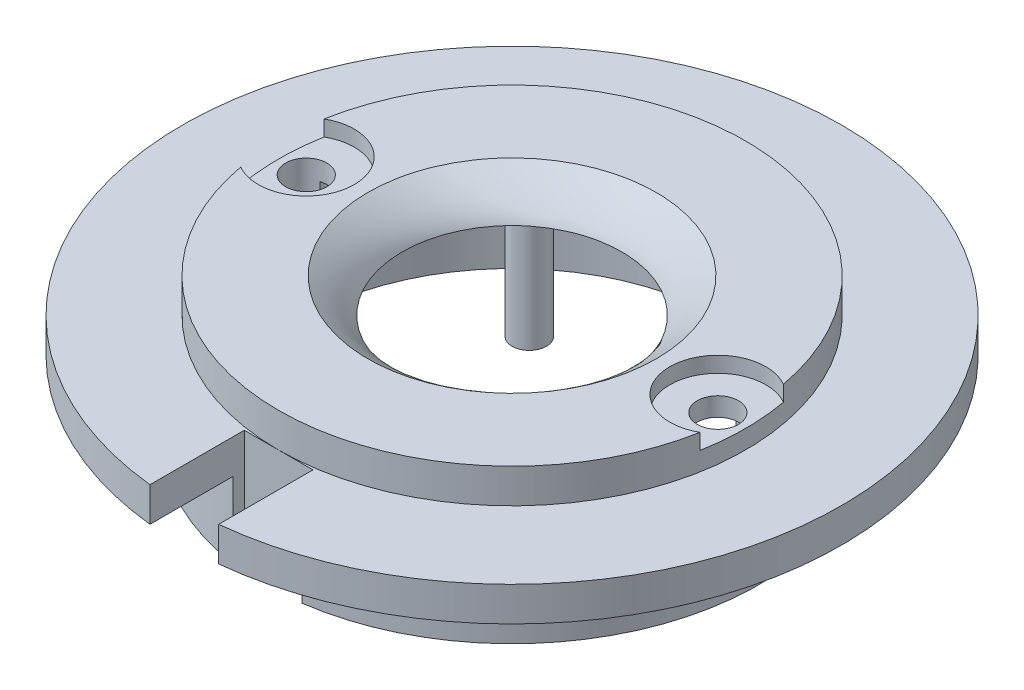
ISO-10303-21;
HEADER;
FILE_DESCRIPTION(('STEP AP214'),'2;1');
FILE_NAME('part.step','',(''),(''),'','','');
FILE_SCHEMA(('AUTOMOTIVE_DESIGN { 1 0 10303 214 1 1 1 1 }'));
ENDSEC;
DATA;
#1=APPLICATION_CONTEXT('core data for automotive mechanical design processes');
#2=APPLICATION_PROTOCOL_DEFINITION('international standard','automotive_design',2000,#1);
#3=PRODUCT_CONTEXT('',#1,'mechanical');
#4=PRODUCT('Part','Part','',(#3));
#5=PRODUCT_RELATED_PRODUCT_CATEGORY('part','',(#4));
#6=PRODUCT_DEFINITION_FORMATION('','',#4);
#7=PRODUCT_DEFINITION_CONTEXT('part definition',#1,'design');
#8=PRODUCT_DEFINITION('design','',#6,#7);
#9=PRODUCT_DEFINITION_SHAPE('','',#8);
#10=(LENGTH_UNIT() NAMED_UNIT(*) SI_UNIT(.MILLI.,.METRE.));
#11=(NAMED_UNIT(*) PLANE_ANGLE_UNIT() SI_UNIT($,.RADIAN.));
#12=(NAMED_UNIT(*) SI_UNIT($,.STERADIAN.) SOLID_ANGLE_UNIT());
#13=UNCERTAINTY_MEASURE_WITH_UNIT(LENGTH_MEASURE(1.E-05),#10,'distance_accuracy_value','');
#14=(GEOMETRIC_REPRESENTATION_CONTEXT(3) GLOBAL_UNCERTAINTY_ASSIGNED_CONTEXT((#13)) GLOBAL_UNIT_ASSIGNED_CONTEXT((#10,
#11,#12)) REPRESENTATION_CONTEXT('',''));
#15=CARTESIAN_POINT('',(0.,0.,0.));
#16=DIRECTION('',(0.,0.,1.));
#17=DIRECTION('',(1.,0.,0.));
#18=AXIS2_PLACEMENT_3D('',#15,#16,#17);
#19=CARTESIAN_POINT('',(19.0334033867562,-10.16,0.));
#20=DIRECTION('',(0.,1.,0.));
#21=DIRECTION('',(0.,0.,1.));
#22=AXIS2_PLACEMENT_3D('',#19,#20,#21);
#23=CYLINDRICAL_SURFACE('',#22,1.905);
#24=DIRECTION('',(0.,1.,0.));
#25=VECTOR('',#24,1.);
#26=CARTESIAN_POINT('',(19.5836628930449,-3.49245,-1.82379809072685));
#27=LINE('',#26,#25);
#28=CARTESIAN_POINT('',(19.5836628930449,0.,-1.82379809072684));
#29=VERTEX_POINT('',#28);
#30=CARTESIAN_POINT('',(19.5836628930449,-10.16,-1.82379809072685));
#31=VERTEX_POINT('',#30);
#32=EDGE_CURVE('E277',#29,#31,#27,.F.);
#33=ORIENTED_EDGE('',*,*,#32,.T.);
#34=CARTESIAN_POINT('',(19.0334033867562,-10.16,0.));
#35=DIRECTION('',(0.,1.,0.));
#36=DIRECTION('',(0.,0.,1.));
#37=AXIS2_PLACEMENT_3D('',#34,#35,#36);
#38=CIRCLE('',#37,1.905);
#39=CARTESIAN_POINT('',(19.5836628930449,-10.16,1.82379809072685));
#40=VERTEX_POINT('',#39);
#41=EDGE_CURVE('E190',#40,#31,#38,.T.);
#42=ORIENTED_EDGE('',*,*,#41,.F.);
#43=DIRECTION('',(0.,1.,0.));
#44=VECTOR('',#43,1.);
#45=CARTESIAN_POINT('',(19.5836628930449,-3.49245,1.82379809072685));
#46=LINE('',#45,#44);
#47=CARTESIAN_POINT('',(19.5836628930449,0.,1.82379809072685));
#48=VERTEX_POINT('',#47);
#49=EDGE_CURVE('E253',#40,#48,#46,.T.);
#50=ORIENTED_EDGE('',*,*,#49,.T.);
#51=CARTESIAN_POINT('',(19.0334033867562,0.,0.));
#52=DIRECTION('',(0.,1.,0.));
#53=DIRECTION('',(0.,0.,1.));
#54=AXIS2_PLACEMENT_3D('',#51,#52,#53);
#55=CIRCLE('',#54,1.905);
#56=EDGE_CURVE('E193',#29,#48,#55,.T.);
#57=ORIENTED_EDGE('',*,*,#56,.F.);
#58=EDGE_LOOP('',(#33,#42,#50,#57));
#59=FACE_BOUND('',#58,.T.);
#60=CARTESIAN_POINT('',(19.0334033867562,1.7272,0.));
#61=DIRECTION('',(0.,1.,0.));
#62=DIRECTION('',(0.,0.,1.));
#63=AXIS2_PLACEMENT_3D('',#60,#61,#62);
#64=CIRCLE('',#63,1.905);
#65=CARTESIAN_POINT('',(19.0334033867562,1.7272,1.905));
#66=VERTEX_POINT('',#65);
#67=EDGE_CURVE('E332',#66,#66,#64,.F.);
#68=ORIENTED_EDGE('',*,*,#67,.F.);
#69=EDGE_LOOP('',(#68));
#70=FACE_BOUND('',#69,.T.);
#71=ADVANCED_FACE('F48',(#59,#70),#23,.F.);
#72=CARTESIAN_POINT('',(-19.0334033867562,-10.16,0.));
#73=DIRECTION('',(0.,1.,0.));
#74=DIRECTION('',(0.,0.,1.));
#75=AXIS2_PLACEMENT_3D('',#72,#73,#74);
#76=CYLINDRICAL_SURFACE('',#75,1.905);
#77=DIRECTION('',(0.,1.,0.));
#78=VECTOR('',#77,1.);
#79=CARTESIAN_POINT('',(-19.5836628930449,-3.49245,1.82379809072685));
#80=LINE('',#79,#78);
#81=CARTESIAN_POINT('',(-19.5836628930449,0.,1.82379809072684));
#82=VERTEX_POINT('',#81);
#83=CARTESIAN_POINT('',(-19.5836628930449,-10.16,1.82379809072685));
#84=VERTEX_POINT('',#83);
#85=EDGE_CURVE('E282',#82,#84,#80,.F.);
#86=ORIENTED_EDGE('',*,*,#85,.T.);
#87=CARTESIAN_POINT('',(-19.0334033867562,-10.16,0.));
#88=DIRECTION('',(0.,1.,0.));
#89=DIRECTION('',(0.,0.,1.));
#90=AXIS2_PLACEMENT_3D('',#87,#88,#89);
#91=CIRCLE('',#90,1.905);
#92=CARTESIAN_POINT('',(-19.5836628930449,-10.16,-1.82379809072685));
#93=VERTEX_POINT('',#92);
#94=EDGE_CURVE('E180',#93,#84,#91,.T.);
#95=ORIENTED_EDGE('',*,*,#94,.F.);
#96=DIRECTION('',(0.,1.,0.));
#97=VECTOR('',#96,1.);
#98=CARTESIAN_POINT('',(-19.5836628930449,-3.49245,-1.82379809072685));
#99=LINE('',#98,#97);
#100=CARTESIAN_POINT('',(-19.5836628930449,0.,-1.82379809072686));
#101=VERTEX_POINT('',#100);
#102=EDGE_CURVE('E280',#93,#101,#99,.T.);
#103=ORIENTED_EDGE('',*,*,#102,.T.);
#104=CARTESIAN_POINT('',(-19.0334033867562,0.,0.));
#105=DIRECTION('',(0.,1.,0.));
#106=DIRECTION('',(0.,0.,1.));
#107=AXIS2_PLACEMENT_3D('',#104,#105,#106);
#108=CIRCLE('',#107,1.905);
#109=EDGE_CURVE('E187',#82,#101,#108,.T.);
#110=ORIENTED_EDGE('',*,*,#109,.F.);
#111=EDGE_LOOP('',(#86,#95,#103,#110));
#112=FACE_BOUND('',#111,.T.);
#113=CARTESIAN_POINT('',(-19.0334033867562,1.7272,0.));
#114=DIRECTION('',(0.,1.,0.));
#115=DIRECTION('',(0.,0.,1.));
#116=AXIS2_PLACEMENT_3D('',#113,#114,#115);
#117=CIRCLE('',#116,1.905);
#118=CARTESIAN_POINT('',(-19.0334033867562,1.7272,1.905));
#119=VERTEX_POINT('',#118);
#120=EDGE_CURVE('E338',#119,#119,#117,.F.);
#121=ORIENTED_EDGE('',*,*,#120,.F.);
#122=EDGE_LOOP('',(#121));
#123=FACE_BOUND('',#122,.T.);
#124=ADVANCED_FACE('F318',(#112,#123),#76,.F.);
#125=CARTESIAN_POINT('',(0.,-3.175,0.));
#126=DIRECTION('',(0.,1.,0.));
#127=DIRECTION('',(0.,0.,1.));
#128=AXIS2_PLACEMENT_3D('',#125,#126,#127);
#129=CYLINDRICAL_SURFACE('',#128,30.48);
#130=DIRECTION('',(0.,1.,0.));
#131=VECTOR('',#130,1.);
#132=CARTESIAN_POINT('',(3.175,-3.175,30.3141843861912));
#133=LINE('',#132,#131);
#134=CARTESIAN_POINT('',(3.175,-3.175,30.3141843861912));
#135=VERTEX_POINT('',#134);
#136=CARTESIAN_POINT('',(3.175,0.,30.3141843861912));
#137=VERTEX_POINT('',#136);
#138=EDGE_CURVE('E363',#135,#137,#133,.T.);
#139=ORIENTED_EDGE('',*,*,#138,.F.);
#140=CARTESIAN_POINT('',(0.,-3.175,0.));
#141=DIRECTION('',(0.,1.,0.));
#142=DIRECTION('',(0.,0.,1.));
#143=AXIS2_PLACEMENT_3D('',#140,#141,#142);
#144=CIRCLE('',#143,30.48);
#145=CARTESIAN_POINT('',(-3.175,-3.175,30.3141843861912));
#146=VERTEX_POINT('',#145);
#147=EDGE_CURVE('E287',#135,#146,#144,.T.);
#148=ORIENTED_EDGE('',*,*,#147,.T.);
#149=DIRECTION('',(0.,1.,0.));
#150=VECTOR('',#149,1.);
#151=CARTESIAN_POINT('',(-3.175,-3.175,30.3141843861912));
#152=LINE('',#151,#150);
#153=CARTESIAN_POINT('',(-3.175,0.,30.3141843861912));
#154=VERTEX_POINT('',#153);
#155=EDGE_CURVE('E355',#154,#146,#152,.F.);
#156=ORIENTED_EDGE('',*,*,#155,.F.);
#157=CARTESIAN_POINT('',(0.,0.,0.));
#158=DIRECTION('',(0.,1.,0.));
#159=DIRECTION('',(0.,0.,1.));
#160=AXIS2_PLACEMENT_3D('',#157,#158,#159);
#161=CIRCLE('',#160,30.48);
#162=EDGE_CURVE('E373',#137,#154,#161,.T.);
#163=ORIENTED_EDGE('',*,*,#162,.F.);
#164=EDGE_LOOP('',(#139,#148,#156,#163));
#165=FACE_BOUND('',#164,.T.);
#166=ADVANCED_FACE('F398',(#165),#129,.T.);
#167=CARTESIAN_POINT('',(0.,0.,0.));
#168=DIRECTION('',(0.,1.,0.));
#169=DIRECTION('',(0.,0.,1.));
#170=AXIS2_PLACEMENT_3D('',#167,#168,#169);
#171=CYLINDRICAL_SURFACE('',#170,22.8434033867562);
#172=DIRECTION('',(0.,1.,0.));
#173=VECTOR('',#172,1.);
#174=CARTESIAN_POINT('',(3.175,0.,22.6216810447425));
#175=LINE('',#174,#173);
#176=CARTESIAN_POINT('',(3.175,-10.16,22.6216810447425));
#177=VERTEX_POINT('',#176);
#178=CARTESIAN_POINT('',(3.175,-3.175,22.6216810447425));
#179=VERTEX_POINT('',#178);
#180=EDGE_CURVE('E367',#177,#179,#175,.T.);
#181=ORIENTED_EDGE('',*,*,#180,.F.);
#182=CARTESIAN_POINT('',(0.,-10.16,0.));
#183=DIRECTION('',(0.,-1.,0.));
#184=DIRECTION('',(0.,0.,-1.));
#185=AXIS2_PLACEMENT_3D('',#182,#183,#184);
#186=CIRCLE('',#185,22.8434033867562);
#187=CARTESIAN_POINT('',(-3.175,-10.16,22.6216810447425));
#188=VERTEX_POINT('',#187);
#189=EDGE_CURVE('E200',#188,#177,#186,.T.);
#190=ORIENTED_EDGE('',*,*,#189,.F.);
#191=DIRECTION('',(0.,1.,0.));
#192=VECTOR('',#191,1.);
#193=CARTESIAN_POINT('',(-3.175,0.,22.6216810447425));
#194=LINE('',#193,#192);
#195=CARTESIAN_POINT('',(-3.175,-3.175,22.6216810447425));
#196=VERTEX_POINT('',#195);
#197=EDGE_CURVE('E361',#196,#188,#194,.F.);
#198=ORIENTED_EDGE('',*,*,#197,.F.);
#199=CARTESIAN_POINT('',(0.,-3.175,0.));
#200=DIRECTION('',(0.,1.,0.));
#201=DIRECTION('',(0.,0.,1.));
#202=AXIS2_PLACEMENT_3D('',#199,#200,#201);
#203=CIRCLE('',#202,22.8434033867562);
#204=EDGE_CURVE('E182',#196,#179,#203,.F.);
#205=ORIENTED_EDGE('',*,*,#204,.T.);
#206=EDGE_LOOP('',(#181,#190,#198,#205));
#207=FACE_BOUND('',#206,.T.);
#208=ADVANCED_FACE('F231',(#207),#171,.T.);
#209=CARTESIAN_POINT('',(0.,3.175,0.));
#210=DIRECTION('',(0.,1.,0.));
#211=DIRECTION('',(0.,0.,1.));
#212=AXIS2_PLACEMENT_3D('',#209,#210,#211);
#213=PLANE('',#212);
#214=CARTESIAN_POINT('',(19.0334033867562,3.175,0.));
#215=DIRECTION('',(0.,1.,0.));
#216=DIRECTION('',(0.,0.,1.));
#217=AXIS2_PLACEMENT_3D('',#214,#215,#216);
#218=CIRCLE('',#217,4.445);
#219=CARTESIAN_POINT('',(21.2426675106789,3.175,-3.85709437669705));
#220=VERTEX_POINT('',#219);
#221=CARTESIAN_POINT('',(21.2426675106789,3.175,3.85709437669705));
#222=VERTEX_POINT('',#221);
#223=EDGE_CURVE('E152',#220,#222,#218,.T.);
#224=ORIENTED_EDGE('',*,*,#223,.F.);
#225=CARTESIAN_POINT('',(0.,3.175,0.));
#226=DIRECTION('',(0.,1.,0.));
#227=DIRECTION('',(0.,0.,1.));
#228=AXIS2_PLACEMENT_3D('',#225,#226,#227);
#229=CIRCLE('',#228,21.59);
#230=CARTESIAN_POINT('',(-21.2426675106789,3.175,-3.85709437669705));
#231=VERTEX_POINT('',#230);
#232=EDGE_CURVE('E177',#220,#231,#229,.T.);
#233=ORIENTED_EDGE('',*,*,#232,.T.);
#234=CARTESIAN_POINT('',(-19.0334033867562,3.175,0.));
#235=DIRECTION('',(0.,1.,0.));
#236=DIRECTION('',(0.,0.,1.));
#237=AXIS2_PLACEMENT_3D('',#234,#235,#236);
#238=CIRCLE('',#237,4.445);
#239=CARTESIAN_POINT('',(-21.2426675106789,3.175,3.85709437669705));
#240=VERTEX_POINT('',#239);
#241=EDGE_CURVE('E175',#240,#231,#238,.T.);
#242=ORIENTED_EDGE('',*,*,#241,.F.);
#243=EDGE_CURVE('E169',#240,#222,#229,.T.);
#244=ORIENTED_EDGE('',*,*,#243,.T.);
#245=EDGE_LOOP('',(#224,#233,#242,#244));
#246=FACE_BOUND('',#245,.T.);
#247=CARTESIAN_POINT('',(0.,3.175,0.));
#248=DIRECTION('',(0.,1.,0.));
#249=DIRECTION('',(0.,0.,1.));
#250=AXIS2_PLACEMENT_3D('',#247,#248,#249);
#251=CIRCLE('',#250,13.335);
#252=CARTESIAN_POINT('',(11.7176932951428,3.175,6.36536635559691));
#253=VERTEX_POINT('',#252);
#254=EDGE_CURVE('E207',#253,#253,#251,.T.);
#255=ORIENTED_EDGE('',*,*,#254,.F.);
#256=EDGE_LOOP('',(#255));
#257=FACE_BOUND('',#256,.T.);
#258=ADVANCED_FACE('F50',(#246,#257),#213,.T.);
#259=CARTESIAN_POINT('',(0.,-10.16,0.));
#260=DIRECTION('',(0.,1.,0.));
#261=DIRECTION('',(0.,0.,1.));
#262=AXIS2_PLACEMENT_3D('',#259,#260,#261);
#263=CYLINDRICAL_SURFACE('',#262,19.6684033867562);
#264=ORIENTED_EDGE('',*,*,#85,.F.);
#265=CARTESIAN_POINT('',(0.,0.,0.));
#266=DIRECTION('',(0.,-1.,0.));
#267=DIRECTION('',(0.,0.,-1.));
#268=AXIS2_PLACEMENT_3D('',#265,#266,#267);
#269=CIRCLE('',#268,19.6684033867562);
#270=EDGE_CURVE('E202',#48,#82,#269,.T.);
#271=ORIENTED_EDGE('',*,*,#270,.F.);
#272=ORIENTED_EDGE('',*,*,#49,.F.);
#273=CARTESIAN_POINT('',(0.,-10.16,0.));
#274=DIRECTION('',(0.,-1.,0.));
#275=DIRECTION('',(0.,0.,-1.));
#276=AXIS2_PLACEMENT_3D('',#273,#274,#275);
#277=CIRCLE('',#276,19.6684033867562);
#278=EDGE_CURVE('E197',#40,#84,#277,.T.);
#279=ORIENTED_EDGE('',*,*,#278,.T.);
#280=EDGE_LOOP('',(#264,#271,#272,#279));
#281=FACE_BOUND('',#280,.T.);
#282=ADVANCED_FACE('F307',(#281),#263,.F.);
#283=CARTESIAN_POINT('',(0.,0.,0.));
#284=DIRECTION('',(0.,1.,0.));
#285=DIRECTION('',(0.,0.,1.));
#286=AXIS2_PLACEMENT_3D('',#283,#284,#285);
#287=PLANE('',#286);
#288=CARTESIAN_POINT('',(-10.7197632946439,0.,-12.3120540490389));
#289=DIRECTION('',(0.,1.,0.));
#290=DIRECTION('',(0.,0.,1.));
#291=AXIS2_PLACEMENT_3D('',#288,#289,#290);
#292=CIRCLE('',#291,1.58749999998063);
#293=CARTESIAN_POINT('',(-10.7197632946439,0.,-10.7245540490583));
#294=VERTEX_POINT('',#293);
#295=EDGE_CURVE('E12',#294,#294,#292,.F.);
#296=ORIENTED_EDGE('',*,*,#295,.F.);
#297=EDGE_LOOP('',(#296));
#298=FACE_BOUND('',#297,.T.);
#299=CARTESIAN_POINT('',(10.2769421250381,0.,-12.6840238315442));
#300=DIRECTION('',(0.,1.,0.));
#301=DIRECTION('',(0.,0.,1.));
#302=AXIS2_PLACEMENT_3D('',#299,#300,#301);
#303=CIRCLE('',#302,1.58749999998063);
#304=CARTESIAN_POINT('',(10.2769421250381,0.,-11.0965238315636));
#305=VERTEX_POINT('',#304);
#306=EDGE_CURVE('E57',#305,#305,#303,.F.);
#307=ORIENTED_EDGE('',*,*,#306,.F.);
#308=EDGE_LOOP('',(#307));
#309=FACE_BOUND('',#308,.T.);
#310=CARTESIAN_POINT('',(0.,0.,0.));
#311=DIRECTION('',(0.,-1.,0.));
#312=DIRECTION('',(0.,0.,-1.));
#313=AXIS2_PLACEMENT_3D('',#310,#311,#312);
#314=CIRCLE('',#313,10.16);
#315=CARTESIAN_POINT('',(5.25951368510445,0.,8.69270474571634));
#316=VERTEX_POINT('',#315);
#317=EDGE_CURVE('E249',#316,#316,#314,.T.);
#318=ORIENTED_EDGE('',*,*,#317,.F.);
#319=EDGE_LOOP('',(#318));
#320=FACE_BOUND('',#319,.T.);
#321=ORIENTED_EDGE('',*,*,#270,.T.);
#322=ORIENTED_EDGE('',*,*,#109,.T.);
#323=EDGE_CURVE('E196',#101,#29,#269,.T.);
#324=ORIENTED_EDGE('',*,*,#323,.T.);
#325=ORIENTED_EDGE('',*,*,#56,.T.);
#326=EDGE_LOOP('',(#321,#322,#324,#325));
#327=FACE_BOUND('',#326,.T.);
#328=ADVANCED_FACE('F230',(#298,#309,#320,#327),#287,.F.);
#329=CARTESIAN_POINT('',(11.7176932951428,3.175,6.36536635559691));
#330=CARTESIAN_POINT('',(5.25951368510445,0.,8.69270474571634));
#331=CARTESIAN_POINT('',(-1.01303941605099,3.175,29.8007529458825));
#332=CARTESIAN_POINT('',(-12.1258958063282,0.,19.2117321159252));
#333=CARTESIAN_POINT('',(-24.4484260063366,3.175,17.0700202346887));
#334=CARTESIAN_POINT('',(-22.6449231765371,0.,1.8263226244926));
#335=CARTESIAN_POINT('',(-11.7176932951428,3.175,-6.36536635559691));
#336=CARTESIAN_POINT('',(-5.25951368510444,0.,-8.6927047457163));
#337=CARTESIAN_POINT('',(1.01303941605101,3.175,-29.8007529458826));
#338=CARTESIAN_POINT('',(12.1258958063282,0.,-19.2117321159252));
#339=CARTESIAN_POINT('',(24.4484260063366,3.175,-17.0700202346887));
#340=CARTESIAN_POINT('',(22.6449231765371,0.,-1.82632262449255));
#341=CARTESIAN_POINT('',(11.7176932951428,3.175,6.36536635559691));
#342=CARTESIAN_POINT('',(5.25951368510445,0.,8.69270474571634));
#343=(BOUNDED_SURFACE() B_SPLINE_SURFACE(3,1,((#329,#330),(#331,#332),(#333,#334),(#335,#336),
(#337,#338),(#339,#340),(#341,#342)),.UNSPECIFIED.,.T.,.F.,.F.) B_SPLINE_SURFACE_WITH_KNOTS((4,
3,4),(2,2),(0.,0.5,1.),(0.,1.),
.UNSPECIFIED.) GEOMETRIC_REPRESENTATION_ITEM() RATIONAL_B_SPLINE_SURFACE(((1.,1.),
(0.333333333333333,0.333333333333333),(0.333333333333333,0.333333333333333),(1.,1.),
(0.333333333333333,0.333333333333333),(0.333333333333333,0.333333333333333),(1.,1.))) REPRESENTATION_ITEM('') SURFACE());
#344=CARTESIAN_POINT('',(11.7176932951428,3.175,6.36536635559691));
#345=CARTESIAN_POINT('',(11.6504205908716,3.14192708333333,6.38960946382732));
#346=CARTESIAN_POINT('',(11.5831478866004,3.10885416666667,6.41385257205773));
#347=CARTESIAN_POINT('',(11.4486024780579,3.04270833333333,6.46233878851855));
#348=CARTESIAN_POINT('',(11.3813297737867,3.00963541666667,6.48658189674896));
#349=CARTESIAN_POINT('',(11.2467843652442,2.94348958333333,6.53506811320978));
#350=CARTESIAN_POINT('',(11.179511660973,2.91041666666667,6.55931122144019));
#351=CARTESIAN_POINT('',(11.0449662524305,2.84427083333333,6.60779743790101));
#352=CARTESIAN_POINT('',(10.9776935481593,2.81119791666667,6.63204054613142));
#353=CARTESIAN_POINT('',(10.8431481396168,2.74505208333333,6.68052676259225));
#354=CARTESIAN_POINT('',(10.7758754353456,2.71197916666667,6.70476987082266));
#355=CARTESIAN_POINT('',(10.6413300268031,2.64583333333333,6.75325608728348));
#356=CARTESIAN_POINT('',(10.5740573225319,2.61276041666667,6.77749919551389));
#357=CARTESIAN_POINT('',(10.4395119139894,2.54661458333333,6.82598541197471));
#358=CARTESIAN_POINT('',(10.3722392097182,2.51354166666667,6.85022852020512));
#359=CARTESIAN_POINT('',(10.2376938011757,2.44739583333333,6.89871473666594));
#360=CARTESIAN_POINT('',(10.1704210969045,2.41432291666667,6.92295784489635));
#361=CARTESIAN_POINT('',(10.035875688362,2.34817708333333,6.97144406135718));
#362=CARTESIAN_POINT('',(9.96860298409076,2.31510416666667,6.99568716958759));
#363=CARTESIAN_POINT('',(9.83405757554829,2.24895833333333,7.04417338604841));
#364=CARTESIAN_POINT('',(9.76678487127706,2.21588541666667,7.06841649427882));
#365=CARTESIAN_POINT('',(9.6322394627346,2.14973958333333,7.11690271073964));
#366=CARTESIAN_POINT('',(9.56496675846336,2.11666666666667,7.14114581897005));
#367=CARTESIAN_POINT('',(9.43042134992089,2.05052083333333,7.18963203543087));
#368=CARTESIAN_POINT('',(9.36314864564966,2.01744791666667,7.21387514366128));
#369=CARTESIAN_POINT('',(9.2286032371072,1.95130208333333,7.2623613601221));
#370=CARTESIAN_POINT('',(9.16133053283597,1.91822916666667,7.28660446835252));
#371=CARTESIAN_POINT('',(9.0267851242935,1.85208333333333,7.33509068481334));
#372=CARTESIAN_POINT('',(8.95951242002227,1.81901041666667,7.35933379304375));
#373=CARTESIAN_POINT('',(8.8249670114798,1.75286458333333,7.40782000950457));
#374=CARTESIAN_POINT('',(8.75769430720857,1.71979166666667,7.43206311773498));
#375=CARTESIAN_POINT('',(8.6231488986661,1.65364583333333,7.4805493341958));
#376=CARTESIAN_POINT('',(8.55587619439487,1.62057291666667,7.50479244242621));
#377=CARTESIAN_POINT('',(8.4213307858524,1.55442708333333,7.55327865888703));
#378=CARTESIAN_POINT('',(8.35405808158117,1.52135416666667,7.57752176711744));
#379=CARTESIAN_POINT('',(8.2195126730387,1.45520833333333,7.62600798357827));
#380=CARTESIAN_POINT('',(8.15223996876747,1.42213541666667,7.65025109180868));
#381=CARTESIAN_POINT('',(8.017694560225,1.35598958333333,7.6987373082695));
#382=CARTESIAN_POINT('',(7.95042185595377,1.32291666666667,7.72298041649991));
#383=CARTESIAN_POINT('',(7.81587644741131,1.25677083333333,7.77146663296073));
#384=CARTESIAN_POINT('',(7.74860374314007,1.22369791666667,7.79570974119114));
#385=CARTESIAN_POINT('',(7.61405833459761,1.15755208333333,7.84419595765196));
#386=CARTESIAN_POINT('',(7.54678563032637,1.12447916666667,7.86843906588237));
#387=CARTESIAN_POINT('',(7.41224022178391,1.05833333333333,7.9169252823432));
#388=CARTESIAN_POINT('',(7.34496751751267,1.02526041666667,7.9411683905736));
#389=CARTESIAN_POINT('',(7.21042210897021,0.959114583333333,7.98965460703443));
#390=CARTESIAN_POINT('',(7.14314940469898,0.926041666666667,8.01389771526484));
#391=CARTESIAN_POINT('',(7.00860399615651,0.859895833333333,8.06238393172566));
#392=CARTESIAN_POINT('',(6.94133129188528,0.826822916666667,8.08662703995607));
#393=CARTESIAN_POINT('',(6.80678588334281,0.760677083333333,8.13511325641689));
#394=CARTESIAN_POINT('',(6.73951317907158,0.727604166666667,8.1593563646473));
#395=CARTESIAN_POINT('',(6.60496777052911,0.661458333333333,8.20784258110812));
#396=CARTESIAN_POINT('',(6.53769506625788,0.628385416666666,8.23208568933853));
#397=CARTESIAN_POINT('',(6.40314965771541,0.562239583333333,8.28057190579936));
#398=CARTESIAN_POINT('',(6.33587695344418,0.529166666666667,8.30481501402977));
#399=CARTESIAN_POINT('',(6.20133154490171,0.463020833333333,8.35330123049059));
#400=CARTESIAN_POINT('',(6.13405884063048,0.429947916666667,8.377544338721));
#401=CARTESIAN_POINT('',(5.99951343208802,0.363802083333333,8.42603055518182));
#402=CARTESIAN_POINT('',(5.93224072781678,0.330729166666667,8.45027366341223));
#403=CARTESIAN_POINT('',(5.79769531927432,0.264583333333333,8.49875987987305));
#404=CARTESIAN_POINT('',(5.73042261500308,0.231510416666667,8.52300298810346));
#405=CARTESIAN_POINT('',(5.59587720646062,0.165364583333333,8.57148920456428));
#406=CARTESIAN_POINT('',(5.52860450218938,0.132291666666667,8.5957323127947));
#407=CARTESIAN_POINT('',(5.39405909364692,0.0661458333333335,8.64421852925552));
#408=CARTESIAN_POINT('',(5.32678638937569,0.0330729166666669,8.66846163748593));
#409=CARTESIAN_POINT('',(5.25951368510445,0.,8.69270474571634));
#410=B_SPLINE_CURVE_WITH_KNOTS('',3,(#344,#345,#346,#347,#348,#349,#350,#351,#352,#353,#354,
#355,#356,#357,#358,#359,#360,#361,#362,#363,#364,#365,#366,#367,#368,#369,#370,#371,#372,#373,
#374,#375,#376,#377,#378,#379,#380,#381,#382,#383,#384,#385,#386,#387,#388,#389,#390,#391,#392,
#393,#394,#395,#396,#397,#398,#399,#400,#401,#402,#403,#404,#405,#406,#407,#408,#409),
.UNSPECIFIED.,.F.,.F.,(4,2,2,2,2,2,2,2,2,2,2,2,2,2,2,2,2,2,2,2,2,2,2,2,2,2,2,2,2,2,2,2,4),(0.,
0.236356649327427,0.472713298654853,0.709069947982279,0.945426597309706,1.18178324663713,
1.41813989596456,1.65449654529199,1.89085319461941,2.12720984394684,2.36356649327426,
2.59992314260169,2.83627979192912,3.07263644125654,3.30899309058397,3.5453497399114,
3.78170638923882,4.01806303856625,4.25441968789368,4.4907763372211,4.72713298654853,
4.96348963587596,5.19984628520338,5.43620293453081,5.67255958385824,5.90891623318566,
6.14527288251309,6.38162953184052,6.61798618116794,6.85434283049537,7.0906994798228,
7.32705612915022,7.56341277847765),.UNSPECIFIED.);
#411=EDGE_CURVE('BSEAM218',#253,#316,#410,.T.);
#412=ORIENTED_EDGE('',*,*,#254,.T.);
#413=ORIENTED_EDGE('',*,*,#317,.T.);
#414=ORIENTED_EDGE('',*,*,#411,.T.);
#415=ORIENTED_EDGE('',*,*,#411,.F.);
#416=EDGE_LOOP('',(#412,#414,#413,#415));
#417=FACE_BOUND('',#416,.T.);
#418=ADVANCED_FACE('F218',(#417),#343,.F.);
#419=CARTESIAN_POINT('',(0.,-10.16,0.));
#420=DIRECTION('',(0.,-1.,0.));
#421=DIRECTION('',(0.,0.,-1.));
#422=AXIS2_PLACEMENT_3D('',#419,#420,#421);
#423=PLANE('',#422);
#424=DIRECTION('',(0.,0.,-1.));
#425=VECTOR('',#424,1.);
#426=CARTESIAN_POINT('',(3.175,-10.16,21.59));
#427=LINE('',#426,#425);
#428=CARTESIAN_POINT('',(3.175,-10.16,21.59));
#429=VERTEX_POINT('',#428);
#430=EDGE_CURVE('E342',#177,#429,#427,.T.);
#431=ORIENTED_EDGE('',*,*,#430,.T.);
#432=DIRECTION('',(-1.,0.,0.));
#433=VECTOR('',#432,1.);
#434=CARTESIAN_POINT('',(-3.175,-10.16,21.59));
#435=LINE('',#434,#433);
#436=CARTESIAN_POINT('',(-3.175,-10.16,21.59));
#437=VERTEX_POINT('',#436);
#438=EDGE_CURVE('E345',#429,#437,#435,.T.);
#439=ORIENTED_EDGE('',*,*,#438,.T.);
#440=DIRECTION('',(0.,0.,1.));
#441=VECTOR('',#440,1.);
#442=CARTESIAN_POINT('',(-3.175,-10.16,21.59));
#443=LINE('',#442,#441);
#444=EDGE_CURVE('E348',#437,#188,#443,.T.);
#445=ORIENTED_EDGE('',*,*,#444,.T.);
#446=ORIENTED_EDGE('',*,*,#189,.T.);
#447=EDGE_LOOP('',(#431,#439,#445,#446));
#448=FACE_BOUND('',#447,.T.);
#449=ORIENTED_EDGE('',*,*,#94,.T.);
#450=ORIENTED_EDGE('',*,*,#278,.F.);
#451=ORIENTED_EDGE('',*,*,#41,.T.);
#452=EDGE_CURVE('E201',#93,#31,#277,.T.);
#453=ORIENTED_EDGE('',*,*,#452,.F.);
#454=EDGE_LOOP('',(#449,#450,#451,#453));
#455=FACE_BOUND('',#454,.T.);
#456=ADVANCED_FACE('F229',(#448,#455),#423,.T.);
#457=ORIENTED_EDGE('',*,*,#102,.F.);
#458=ORIENTED_EDGE('',*,*,#452,.T.);
#459=ORIENTED_EDGE('',*,*,#32,.F.);
#460=ORIENTED_EDGE('',*,*,#323,.F.);
#461=EDGE_LOOP('',(#457,#458,#459,#460));
#462=FACE_BOUND('',#461,.T.);
#463=ADVANCED_FACE('F325',(#462),#263,.F.);
#464=CARTESIAN_POINT('',(0.,0.,0.));
#465=DIRECTION('',(0.,1.,0.));
#466=DIRECTION('',(0.,0.,1.));
#467=AXIS2_PLACEMENT_3D('',#464,#465,#466);
#468=PLANE('',#467);
#469=DIRECTION('',(0.,0.,-1.));
#470=VECTOR('',#469,1.);
#471=CARTESIAN_POINT('',(3.17499999999999,0.,0.));
#472=LINE('',#471,#470);
#473=CARTESIAN_POINT('',(3.175,0.,21.59));
#474=VERTEX_POINT('',#473);
#475=EDGE_CURVE('E365',#137,#474,#472,.T.);
#476=ORIENTED_EDGE('',*,*,#475,.F.);
#477=ORIENTED_EDGE('',*,*,#162,.T.);
#478=DIRECTION('',(0.,0.,1.));
#479=VECTOR('',#478,1.);
#480=CARTESIAN_POINT('',(-3.175,0.,0.));
#481=LINE('',#480,#479);
#482=CARTESIAN_POINT('',(-3.175,0.,21.59));
#483=VERTEX_POINT('',#482);
#484=EDGE_CURVE('E359',#483,#154,#481,.T.);
#485=ORIENTED_EDGE('',*,*,#484,.F.);
#486=DIRECTION('',(-1.,0.,0.));
#487=VECTOR('',#486,1.);
#488=CARTESIAN_POINT('',(0.,0.,21.59));
#489=LINE('',#488,#487);
#490=CARTESIAN_POINT('',(0.,0.,21.59));
#491=VERTEX_POINT('',#490);
#492=EDGE_CURVE('E369',#491,#483,#489,.T.);
#493=ORIENTED_EDGE('',*,*,#492,.F.);
#494=CARTESIAN_POINT('',(0.,0.,0.));
#495=DIRECTION('',(0.,1.,0.));
#496=DIRECTION('',(0.,0.,1.));
#497=AXIS2_PLACEMENT_3D('',#494,#495,#496);
#498=CIRCLE('',#497,21.59);
#499=EDGE_CURVE('E176',#491,#491,#498,.T.);
#500=ORIENTED_EDGE('',*,*,#499,.F.);
#501=EDGE_CURVE('E371',#474,#491,#489,.T.);
#502=ORIENTED_EDGE('',*,*,#501,.F.);
#503=EDGE_LOOP('',(#476,#477,#485,#493,#500,#502));
#504=FACE_BOUND('',#503,.T.);
#505=ADVANCED_FACE('F385',(#504),#468,.T.);
#506=CARTESIAN_POINT('',(0.,0.,0.));
#507=DIRECTION('',(0.,1.,0.));
#508=DIRECTION('',(0.,0.,1.));
#509=AXIS2_PLACEMENT_3D('',#506,#507,#508);
#510=CYLINDRICAL_SURFACE('',#509,21.59);
#511=DIRECTION('',(0.,1.,0.));
#512=VECTOR('',#511,1.);
#513=CARTESIAN_POINT('',(21.2426675106789,2.4511,-3.85709437669705));
#514=LINE('',#513,#512);
#515=CARTESIAN_POINT('',(21.2426675106789,1.7272,-3.85709437669705));
#516=VERTEX_POINT('',#515);
#517=EDGE_CURVE('E158',#516,#220,#514,.T.);
#518=ORIENTED_EDGE('',*,*,#517,.F.);
#519=CARTESIAN_POINT('',(0.,1.7272,0.));
#520=DIRECTION('',(0.,1.,0.));
#521=DIRECTION('',(0.,0.,1.));
#522=AXIS2_PLACEMENT_3D('',#519,#520,#521);
#523=CIRCLE('',#522,21.59);
#524=CARTESIAN_POINT('',(21.2426675106789,1.7272,3.85709437669705));
#525=VERTEX_POINT('',#524);
#526=EDGE_CURVE('E170',#516,#525,#523,.F.);
#527=ORIENTED_EDGE('',*,*,#526,.T.);
#528=DIRECTION('',(0.,1.,0.));
#529=VECTOR('',#528,1.);
#530=CARTESIAN_POINT('',(21.2426675106789,2.4511,3.85709437669705));
#531=LINE('',#530,#529);
#532=EDGE_CURVE('E155',#222,#525,#531,.F.);
#533=ORIENTED_EDGE('',*,*,#532,.F.);
#534=ORIENTED_EDGE('',*,*,#243,.F.);
#535=DIRECTION('',(0.,1.,0.));
#536=VECTOR('',#535,1.);
#537=CARTESIAN_POINT('',(-21.2426675106789,2.4511,3.85709437669705));
#538=LINE('',#537,#536);
#539=CARTESIAN_POINT('',(-21.2426675106789,1.7272,3.85709437669705));
#540=VERTEX_POINT('',#539);
#541=EDGE_CURVE('E298',#540,#240,#538,.T.);
#542=ORIENTED_EDGE('',*,*,#541,.F.);
#543=CARTESIAN_POINT('',(0.,1.7272,0.));
#544=DIRECTION('',(0.,1.,0.));
#545=DIRECTION('',(0.,0.,1.));
#546=AXIS2_PLACEMENT_3D('',#543,#544,#545);
#547=CIRCLE('',#546,21.59);
#548=CARTESIAN_POINT('',(-21.2426675106789,1.7272,-3.85709437669705));
#549=VERTEX_POINT('',#548);
#550=EDGE_CURVE('E293',#540,#549,#547,.F.);
#551=ORIENTED_EDGE('',*,*,#550,.T.);
#552=DIRECTION('',(0.,1.,0.));
#553=VECTOR('',#552,1.);
#554=CARTESIAN_POINT('',(-21.2426675106789,2.4511,-3.85709437669705));
#555=LINE('',#554,#553);
#556=EDGE_CURVE('E296',#231,#549,#555,.F.);
#557=ORIENTED_EDGE('',*,*,#556,.F.);
#558=ORIENTED_EDGE('',*,*,#232,.F.);
#559=EDGE_LOOP('',(#518,#527,#533,#534,#542,#551,#557,#558));
#560=FACE_BOUND('',#559,.T.);
#561=ORIENTED_EDGE('',*,*,#499,.T.);
#562=EDGE_LOOP('',(#561));
#563=FACE_BOUND('',#562,.T.);
#564=ADVANCED_FACE('F166',(#560,#563),#510,.T.);
#565=CARTESIAN_POINT('',(0.,-3.175,0.));
#566=DIRECTION('',(0.,1.,0.));
#567=DIRECTION('',(0.,0.,1.));
#568=AXIS2_PLACEMENT_3D('',#565,#566,#567);
#569=PLANE('',#568);
#570=ORIENTED_EDGE('',*,*,#147,.F.);
#571=DIRECTION('',(0.,0.,-1.));
#572=VECTOR('',#571,1.);
#573=CARTESIAN_POINT('',(3.17499999999999,-3.175,0.));
#574=LINE('',#573,#572);
#575=EDGE_CURVE('E290',#135,#179,#574,.T.);
#576=ORIENTED_EDGE('',*,*,#575,.T.);
#577=ORIENTED_EDGE('',*,*,#204,.F.);
#578=DIRECTION('',(0.,0.,1.));
#579=VECTOR('',#578,1.);
#580=CARTESIAN_POINT('',(-3.175,-3.175,0.));
#581=LINE('',#580,#579);
#582=EDGE_CURVE('E284',#196,#146,#581,.T.);
#583=ORIENTED_EDGE('',*,*,#582,.T.);
#584=EDGE_LOOP('',(#570,#576,#577,#583));
#585=FACE_BOUND('',#584,.T.);
#586=ADVANCED_FACE('F387',(#585),#569,.F.);
#587=CARTESIAN_POINT('',(3.175,-10.16,21.59));
#588=DIRECTION('',(1.,0.,0.));
#589=DIRECTION('',(0.,0.,-1.));
#590=AXIS2_PLACEMENT_3D('',#587,#588,#589);
#591=PLANE('',#590);
#592=ORIENTED_EDGE('',*,*,#180,.T.);
#593=ORIENTED_EDGE('',*,*,#575,.F.);
#594=ORIENTED_EDGE('',*,*,#138,.T.);
#595=ORIENTED_EDGE('',*,*,#475,.T.);
#596=DIRECTION('',(0.,1.,0.));
#597=VECTOR('',#596,1.);
#598=CARTESIAN_POINT('',(3.175,-10.16,21.59));
#599=LINE('',#598,#597);
#600=EDGE_CURVE('E351',#429,#474,#599,.T.);
#601=ORIENTED_EDGE('',*,*,#600,.F.);
#602=ORIENTED_EDGE('',*,*,#430,.F.);
#603=EDGE_LOOP('',(#592,#593,#594,#595,#601,#602));
#604=FACE_BOUND('',#603,.T.);
#605=ADVANCED_FACE('F393',(#604),#591,.F.);
#606=CARTESIAN_POINT('',(-3.175,-10.16,21.59));
#607=DIRECTION('',(-1.,0.,0.));
#608=DIRECTION('',(0.,0.,1.));
#609=AXIS2_PLACEMENT_3D('',#606,#607,#608);
#610=PLANE('',#609);
#611=ORIENTED_EDGE('',*,*,#197,.T.);
#612=ORIENTED_EDGE('',*,*,#444,.F.);
#613=DIRECTION('',(0.,1.,0.));
#614=VECTOR('',#613,1.);
#615=CARTESIAN_POINT('',(-3.175,-10.16,21.59));
#616=LINE('',#615,#614);
#617=EDGE_CURVE('E352',#437,#483,#616,.T.);
#618=ORIENTED_EDGE('',*,*,#617,.T.);
#619=ORIENTED_EDGE('',*,*,#484,.T.);
#620=ORIENTED_EDGE('',*,*,#155,.T.);
#621=ORIENTED_EDGE('',*,*,#582,.F.);
#622=EDGE_LOOP('',(#611,#612,#618,#619,#620,#621));
#623=FACE_BOUND('',#622,.T.);
#624=ADVANCED_FACE('F418',(#623),#610,.F.);
#625=CARTESIAN_POINT('',(-3.175,-10.16,21.59));
#626=DIRECTION('',(0.,0.,-1.));
#627=DIRECTION('',(-1.,0.,0.));
#628=AXIS2_PLACEMENT_3D('',#625,#626,#627);
#629=PLANE('',#628);
#630=ORIENTED_EDGE('',*,*,#501,.T.);
#631=ORIENTED_EDGE('',*,*,#492,.T.);
#632=ORIENTED_EDGE('',*,*,#617,.F.);
#633=ORIENTED_EDGE('',*,*,#438,.F.);
#634=ORIENTED_EDGE('',*,*,#600,.T.);
#635=EDGE_LOOP('',(#630,#631,#632,#633,#634));
#636=FACE_BOUND('',#635,.T.);
#637=ADVANCED_FACE('F382',(#636),#629,.F.);
#638=CARTESIAN_POINT('',(-19.0334033867562,1.7272,0.));
#639=DIRECTION('',(0.,1.,0.));
#640=DIRECTION('',(0.,0.,1.));
#641=AXIS2_PLACEMENT_3D('',#638,#639,#640);
#642=PLANE('',#641);
#643=CARTESIAN_POINT('',(-19.0334033867562,1.7272,0.));
#644=DIRECTION('',(0.,1.,0.));
#645=DIRECTION('',(0.,0.,1.));
#646=AXIS2_PLACEMENT_3D('',#643,#644,#645);
#647=CIRCLE('',#646,4.445);
#648=EDGE_CURVE('E70',#540,#549,#647,.T.);
#649=ORIENTED_EDGE('',*,*,#648,.T.);
#650=ORIENTED_EDGE('',*,*,#550,.F.);
#651=EDGE_LOOP('',(#649,#650));
#652=FACE_BOUND('',#651,.T.);
#653=ORIENTED_EDGE('',*,*,#120,.T.);
#654=EDGE_LOOP('',(#653));
#655=FACE_BOUND('',#654,.T.);
#656=ADVANCED_FACE('F426',(#652,#655),#642,.T.);
#657=CARTESIAN_POINT('',(-19.0334033867562,1.7272,0.));
#658=DIRECTION('',(0.,1.,0.));
#659=DIRECTION('',(0.,0.,1.));
#660=AXIS2_PLACEMENT_3D('',#657,#658,#659);
#661=CYLINDRICAL_SURFACE('',#660,4.445);
#662=ORIENTED_EDGE('',*,*,#541,.T.);
#663=ORIENTED_EDGE('',*,*,#241,.T.);
#664=ORIENTED_EDGE('',*,*,#556,.T.);
#665=ORIENTED_EDGE('',*,*,#648,.F.);
#666=EDGE_LOOP('',(#662,#663,#664,#665));
#667=FACE_BOUND('',#666,.T.);
#668=ADVANCED_FACE('F430',(#667),#661,.F.);
#669=CARTESIAN_POINT('',(19.0334033867562,1.7272,0.));
#670=DIRECTION('',(0.,1.,0.));
#671=DIRECTION('',(0.,0.,1.));
#672=AXIS2_PLACEMENT_3D('',#669,#670,#671);
#673=PLANE('',#672);
#674=CARTESIAN_POINT('',(19.0334033867562,1.7272,0.));
#675=DIRECTION('',(0.,1.,0.));
#676=DIRECTION('',(0.,0.,1.));
#677=AXIS2_PLACEMENT_3D('',#674,#675,#676);
#678=CIRCLE('',#677,4.445);
#679=EDGE_CURVE('E63',#516,#525,#678,.T.);
#680=ORIENTED_EDGE('',*,*,#679,.T.);
#681=ORIENTED_EDGE('',*,*,#526,.F.);
#682=EDGE_LOOP('',(#680,#681));
#683=FACE_BOUND('',#682,.T.);
#684=ORIENTED_EDGE('',*,*,#67,.T.);
#685=EDGE_LOOP('',(#684));
#686=FACE_BOUND('',#685,.T.);
#687=ADVANCED_FACE('F433',(#683,#686),#673,.T.);
#688=CARTESIAN_POINT('',(19.0334033867562,1.7272,0.));
#689=DIRECTION('',(0.,1.,0.));
#690=DIRECTION('',(0.,0.,1.));
#691=AXIS2_PLACEMENT_3D('',#688,#689,#690);
#692=CYLINDRICAL_SURFACE('',#691,4.445);
#693=ORIENTED_EDGE('',*,*,#517,.T.);
#694=ORIENTED_EDGE('',*,*,#223,.T.);
#695=ORIENTED_EDGE('',*,*,#532,.T.);
#696=ORIENTED_EDGE('',*,*,#679,.F.);
#697=EDGE_LOOP('',(#693,#694,#695,#696));
#698=FACE_BOUND('',#697,.T.);
#699=ADVANCED_FACE('F154',(#698),#692,.F.);
#700=CARTESIAN_POINT('',(10.2769421250381,-17.7001280604798,-12.6840238315442));
#701=DIRECTION('',(0.,1.,0.));
#702=DIRECTION('',(0.,0.,1.));
#703=AXIS2_PLACEMENT_3D('',#700,#701,#702);
#704=CYLINDRICAL_SURFACE('',#703,1.58749999998063);
#705=CARTESIAN_POINT('',(10.2769421250381,-13.21,-12.6840238315442));
#706=DIRECTION('',(0.,1.,0.));
#707=DIRECTION('',(0.,0.,1.));
#708=AXIS2_PLACEMENT_3D('',#705,#706,#707);
#709=CIRCLE('',#708,1.58749999998063);
#710=CARTESIAN_POINT('',(10.2769421250381,-13.21,-11.0965238315636));
#711=VERTEX_POINT('',#710);
#712=EDGE_CURVE('E162',#711,#711,#709,.T.);
#713=ORIENTED_EDGE('',*,*,#712,.T.);
#714=EDGE_LOOP('',(#713));
#715=FACE_BOUND('',#714,.T.);
#716=ORIENTED_EDGE('',*,*,#306,.T.);
#717=EDGE_LOOP('',(#716));
#718=FACE_BOUND('',#717,.T.);
#719=ADVANCED_FACE('F304',(#715,#718),#704,.T.);
#720=CARTESIAN_POINT('',(1.98521754590786E-11,-13.21,-9.36056787637085E-12));
#721=DIRECTION('',(0.,1.,0.));
#722=DIRECTION('',(0.017712846785966,0.,0.999843115222952));
#723=AXIS2_PLACEMENT_3D('',#720,#721,#722);
#724=PLANE('',#723);
#725=CARTESIAN_POINT('',(10.2769421250381,-13.21,-12.6840238315442));
#726=DIRECTION('',(0.,-1.,0.));
#727=DIRECTION('',(0.,0.,-1.));
#728=AXIS2_PLACEMENT_3D('',#725,#726,#727);
#729=CIRCLE('',#728,1.27000000001938);
#730=CARTESIAN_POINT('',(10.2769421250381,-13.21,-13.9540238315636));
#731=VERTEX_POINT('',#730);
#732=EDGE_CURVE('E477',#731,#731,#729,.T.);
#733=ORIENTED_EDGE('',*,*,#732,.F.);
#734=EDGE_LOOP('',(#733));
#735=FACE_BOUND('',#734,.T.);
#736=ORIENTED_EDGE('',*,*,#712,.F.);
#737=EDGE_LOOP('',(#736));
#738=FACE_BOUND('',#737,.T.);
#739=ADVANCED_FACE('F443',(#735,#738),#724,.F.);
#740=CARTESIAN_POINT('',(-10.7197632946439,-17.7001280604798,-12.3120540490389));
#741=DIRECTION('',(0.,1.,0.));
#742=DIRECTION('',(0.,0.,1.));
#743=AXIS2_PLACEMENT_3D('',#740,#741,#742);
#744=CYLINDRICAL_SURFACE('',#743,1.58749999998063);
#745=CARTESIAN_POINT('',(-10.7197632946439,-13.21,-12.3120540490389));
#746=DIRECTION('',(0.,1.,0.));
#747=DIRECTION('',(0.,0.,1.));
#748=AXIS2_PLACEMENT_3D('',#745,#746,#747);
#749=CIRCLE('',#748,1.58749999998063);
#750=CARTESIAN_POINT('',(-10.7197632946439,-13.21,-10.7245540490583));
#751=VERTEX_POINT('',#750);
#752=EDGE_CURVE('E486',#751,#751,#749,.T.);
#753=ORIENTED_EDGE('',*,*,#752,.T.);
#754=EDGE_LOOP('',(#753));
#755=FACE_BOUND('',#754,.T.);
#756=ORIENTED_EDGE('',*,*,#295,.T.);
#757=EDGE_LOOP('',(#756));
#758=FACE_BOUND('',#757,.T.);
#759=ADVANCED_FACE('F447',(#755,#758),#744,.T.);
#760=CARTESIAN_POINT('',(1.98521754590786E-11,-13.21,-9.36056787637085E-12));
#761=DIRECTION('',(0.,1.,0.));
#762=DIRECTION('',(0.017712846785966,0.,0.999843115222952));
#763=AXIS2_PLACEMENT_3D('',#760,#761,#762);
#764=PLANE('',#763);
#765=CARTESIAN_POINT('',(-10.7197632946439,-13.21,-12.3120540490389));
#766=DIRECTION('',(0.,-1.,0.));
#767=DIRECTION('',(0.,0.,-1.));
#768=AXIS2_PLACEMENT_3D('',#765,#766,#767);
#769=CIRCLE('',#768,1.27000000001938);
#770=CARTESIAN_POINT('',(-10.7197632946439,-13.21,-13.5820540490583));
#771=VERTEX_POINT('',#770);
#772=EDGE_CURVE('E476',#771,#771,#769,.T.);
#773=ORIENTED_EDGE('',*,*,#772,.F.);
#774=EDGE_LOOP('',(#773));
#775=FACE_BOUND('',#774,.T.);
#776=ORIENTED_EDGE('',*,*,#752,.F.);
#777=EDGE_LOOP('',(#776));
#778=FACE_BOUND('',#777,.T.);
#779=ADVANCED_FACE('F451',(#775,#778),#764,.F.);
#780=CARTESIAN_POINT('',(-10.7197632946439,-10.035,-12.3120540490389));
#781=DIRECTION('',(0.,-1.,0.));
#782=DIRECTION('',(0.,0.,-1.));
#783=AXIS2_PLACEMENT_3D('',#780,#781,#782);
#784=CYLINDRICAL_SURFACE('',#783,1.27000000001938);
#785=CARTESIAN_POINT('',(-10.7197632946439,-10.035,-12.3120540490389));
#786=DIRECTION('',(0.,-1.,0.));
#787=DIRECTION('',(0.,0.,-1.));
#788=AXIS2_PLACEMENT_3D('',#785,#786,#787);
#789=CIRCLE('',#788,1.27000000001938);
#790=CARTESIAN_POINT('',(-10.7197632946439,-10.035,-13.5820540490583));
#791=VERTEX_POINT('',#790);
#792=EDGE_CURVE('E480',#791,#791,#789,.T.);
#793=ORIENTED_EDGE('',*,*,#792,.F.);
#794=EDGE_LOOP('',(#793));
#795=FACE_BOUND('',#794,.T.);
#796=ORIENTED_EDGE('',*,*,#772,.T.);
#797=EDGE_LOOP('',(#796));
#798=FACE_BOUND('',#797,.T.);
#799=ADVANCED_FACE('F455',(#795,#798),#784,.F.);
#800=CARTESIAN_POINT('',(-10.7197632946439,-10.035,-12.3120540490389));
#801=DIRECTION('',(0.,-1.,0.));
#802=DIRECTION('',(0.,0.,-1.));
#803=AXIS2_PLACEMENT_3D('',#800,#801,#802);
#804=PLANE('',#803);
#805=ORIENTED_EDGE('',*,*,#792,.T.);
#806=EDGE_LOOP('',(#805));
#807=FACE_BOUND('',#806,.T.);
#808=ADVANCED_FACE('F459',(#807),#804,.T.);
#809=CARTESIAN_POINT('',(10.2769421250381,-10.035,-12.6840238315442));
#810=DIRECTION('',(0.,-1.,0.));
#811=DIRECTION('',(0.,0.,-1.));
#812=AXIS2_PLACEMENT_3D('',#809,#810,#811);
#813=CYLINDRICAL_SURFACE('',#812,1.27000000001938);
#814=CARTESIAN_POINT('',(10.2769421250381,-10.035,-12.6840238315442));
#815=DIRECTION('',(0.,-1.,0.));
#816=DIRECTION('',(0.,0.,-1.));
#817=AXIS2_PLACEMENT_3D('',#814,#815,#816);
#818=CIRCLE('',#817,1.27000000001938);
#819=CARTESIAN_POINT('',(10.2769421250381,-10.035,-13.9540238315636));
#820=VERTEX_POINT('',#819);
#821=EDGE_CURVE('E475',#820,#820,#818,.T.);
#822=ORIENTED_EDGE('',*,*,#821,.F.);
#823=EDGE_LOOP('',(#822));
#824=FACE_BOUND('',#823,.T.);
#825=ORIENTED_EDGE('',*,*,#732,.T.);
#826=EDGE_LOOP('',(#825));
#827=FACE_BOUND('',#826,.T.);
#828=ADVANCED_FACE('F463',(#824,#827),#813,.F.);
#829=CARTESIAN_POINT('',(10.2769421250381,-10.035,-12.6840238315442));
#830=DIRECTION('',(0.,-1.,0.));
#831=DIRECTION('',(0.,0.,-1.));
#832=AXIS2_PLACEMENT_3D('',#829,#830,#831);
#833=PLANE('',#832);
#834=ORIENTED_EDGE('',*,*,#821,.T.);
#835=EDGE_LOOP('',(#834));
#836=FACE_BOUND('',#835,.T.);
#837=ADVANCED_FACE('F467',(#836),#833,.T.);
#838=CLOSED_SHELL('',(#71,#124,#166,#208,#258,#282,#328,#418,#456,#463,#505,#564,#586,#605,#624,
#637,#656,#668,#687,#699,#719,#739,#759,#779,#799,#808,#828,#837));
#839=MANIFOLD_SOLID_BREP('B2',#838);
#840=ADVANCED_BREP_SHAPE_REPRESENTATION('',(#18,#839),#14);
#841=SHAPE_DEFINITION_REPRESENTATION(#9,#840);
ENDSEC;
END-ISO-10303-21;
